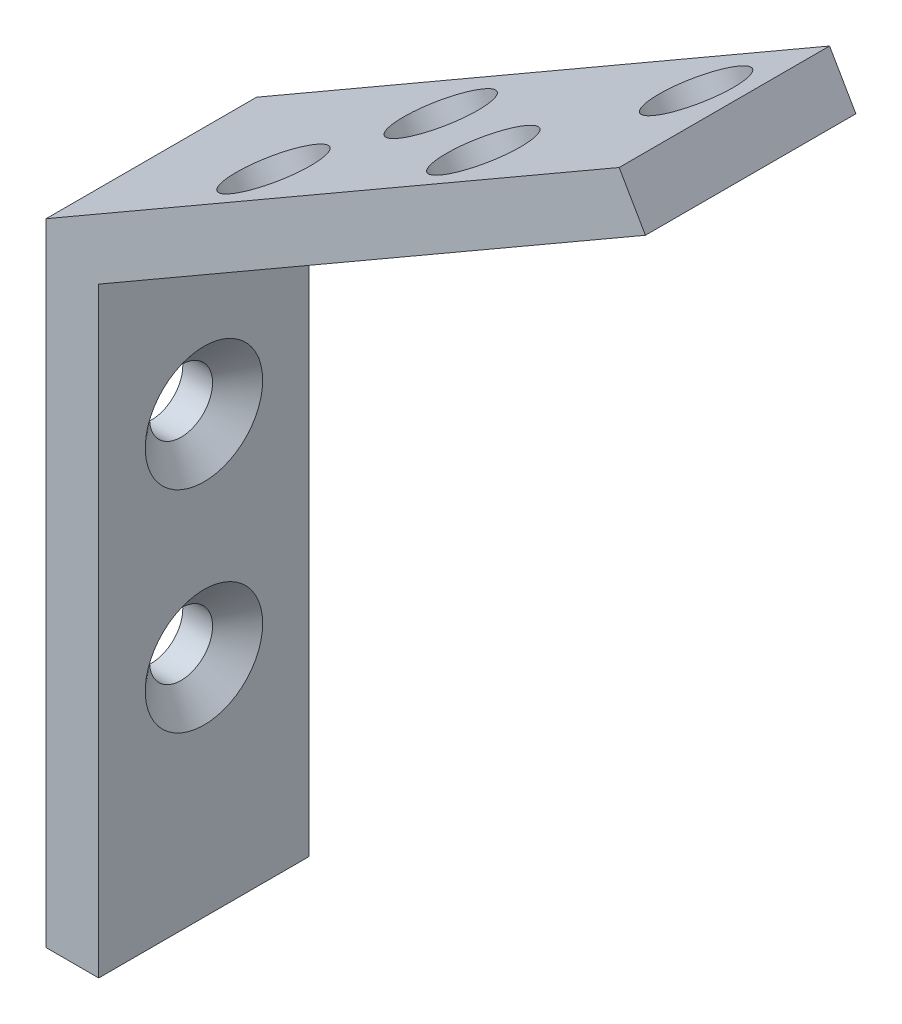
ISO-10303-21;
HEADER;
FILE_DESCRIPTION(('STEP AP214'),'2;1');
FILE_NAME('part.step','',(''),(''),'','','');
FILE_SCHEMA(('AUTOMOTIVE_DESIGN { 1 0 10303 214 1 1 1 1 }'));
ENDSEC;
DATA;
#1=APPLICATION_CONTEXT('core data for automotive mechanical design processes');
#2=APPLICATION_PROTOCOL_DEFINITION('international standard','automotive_design',2000,#1);
#3=PRODUCT_CONTEXT('',#1,'mechanical');
#4=PRODUCT('Part','Part','',(#3));
#5=PRODUCT_RELATED_PRODUCT_CATEGORY('part','',(#4));
#6=PRODUCT_DEFINITION_FORMATION('','',#4);
#7=PRODUCT_DEFINITION_CONTEXT('part definition',#1,'design');
#8=PRODUCT_DEFINITION('design','',#6,#7);
#9=PRODUCT_DEFINITION_SHAPE('','',#8);
#10=(LENGTH_UNIT() NAMED_UNIT(*) SI_UNIT(.MILLI.,.METRE.));
#11=(NAMED_UNIT(*) PLANE_ANGLE_UNIT() SI_UNIT($,.RADIAN.));
#12=(NAMED_UNIT(*) SI_UNIT($,.STERADIAN.) SOLID_ANGLE_UNIT());
#13=UNCERTAINTY_MEASURE_WITH_UNIT(LENGTH_MEASURE(1.E-05),#10,'distance_accuracy_value','');
#14=(GEOMETRIC_REPRESENTATION_CONTEXT(3) GLOBAL_UNCERTAINTY_ASSIGNED_CONTEXT((#13)) GLOBAL_UNIT_ASSIGNED_CONTEXT((#10,
#11,#12)) REPRESENTATION_CONTEXT('',''));
#15=CARTESIAN_POINT('',(0.,0.,0.));
#16=DIRECTION('',(0.,0.,1.));
#17=DIRECTION('',(1.,0.,0.));
#18=AXIS2_PLACEMENT_3D('',#15,#16,#17);
#19=CARTESIAN_POINT('',(-1.5875,-19.05,12.7));
#20=DIRECTION('',(1.,0.,0.));
#21=DIRECTION('',(0.,1.,0.));
#22=AXIS2_PLACEMENT_3D('',#19,#20,#21);
#23=PLANE('',#22);
#24=CARTESIAN_POINT('',(-1.5875,7.24790712370194,6.35));
#25=DIRECTION('',(1.,0.,0.));
#26=DIRECTION('',(0.,1.,0.));
#27=AXIS2_PLACEMENT_3D('',#24,#25,#26);
#28=CIRCLE('',#27,1.89864999999999);
#29=CARTESIAN_POINT('',(-1.5875,9.14655712370193,6.35));
#30=VERTEX_POINT('',#29);
#31=EDGE_CURVE('E36',#30,#30,#28,.T.);
#32=ORIENTED_EDGE('',*,*,#31,.T.);
#33=EDGE_LOOP('',(#32));
#34=FACE_BOUND('',#33,.T.);
#35=CARTESIAN_POINT('',(-1.5875,-5.46366721304636,6.35));
#36=DIRECTION('',(1.,0.,0.));
#37=DIRECTION('',(0.,1.,0.));
#38=AXIS2_PLACEMENT_3D('',#35,#36,#37);
#39=CIRCLE('',#38,1.89864999999999);
#40=CARTESIAN_POINT('',(-1.5875,-3.56501721304637,6.35));
#41=VERTEX_POINT('',#40);
#42=EDGE_CURVE('E123',#41,#41,#39,.T.);
#43=ORIENTED_EDGE('',*,*,#42,.T.);
#44=EDGE_LOOP('',(#43));
#45=FACE_BOUND('',#44,.T.);
#46=DIRECTION('',(0.,-1.,0.));
#47=VECTOR('',#46,1.);
#48=CARTESIAN_POINT('',(-1.5875,-19.05,0.));
#49=LINE('',#48,#47);
#50=CARTESIAN_POINT('',(-1.5875,19.05,0.));
#51=VERTEX_POINT('',#50);
#52=CARTESIAN_POINT('',(-1.5875,-19.05,0.));
#53=VERTEX_POINT('',#52);
#54=EDGE_CURVE('E119',#51,#53,#49,.T.);
#55=ORIENTED_EDGE('',*,*,#54,.T.);
#56=DIRECTION('',(0.,0.,-1.));
#57=VECTOR('',#56,1.);
#58=CARTESIAN_POINT('',(-1.5875,-19.05,12.7));
#59=LINE('',#58,#57);
#60=CARTESIAN_POINT('',(-1.5875,-19.05,12.7));
#61=VERTEX_POINT('',#60);
#62=EDGE_CURVE('E11',#61,#53,#59,.T.);
#63=ORIENTED_EDGE('',*,*,#62,.F.);
#64=DIRECTION('',(0.,-1.,0.));
#65=VECTOR('',#64,1.);
#66=CARTESIAN_POINT('',(-1.5875,-19.05,12.7));
#67=LINE('',#66,#65);
#68=CARTESIAN_POINT('',(-1.5875,19.05,12.7));
#69=VERTEX_POINT('',#68);
#70=EDGE_CURVE('E130',#69,#61,#67,.T.);
#71=ORIENTED_EDGE('',*,*,#70,.F.);
#72=DIRECTION('',(0.,0.,-1.));
#73=VECTOR('',#72,1.);
#74=CARTESIAN_POINT('',(-1.5875,19.05,12.7));
#75=LINE('',#74,#73);
#76=EDGE_CURVE('E115',#69,#51,#75,.T.);
#77=ORIENTED_EDGE('',*,*,#76,.T.);
#78=EDGE_LOOP('',(#55,#63,#71,#77));
#79=FACE_BOUND('',#78,.T.);
#80=ADVANCED_FACE('F33',(#34,#45,#79),#23,.F.);
#81=CARTESIAN_POINT('',(-1.5875,-19.05,12.7));
#82=DIRECTION('',(0.,1.,0.));
#83=DIRECTION('',(0.,0.,1.));
#84=AXIS2_PLACEMENT_3D('',#81,#82,#83);
#85=PLANE('',#84);
#86=DIRECTION('',(1.,0.,0.));
#87=VECTOR('',#86,1.);
#88=CARTESIAN_POINT('',(-1.5875,-19.05,0.));
#89=LINE('',#88,#87);
#90=CARTESIAN_POINT('',(1.5875,-19.05,0.));
#91=VERTEX_POINT('',#90);
#92=EDGE_CURVE('E122',#53,#91,#89,.T.);
#93=ORIENTED_EDGE('',*,*,#92,.T.);
#94=DIRECTION('',(0.,0.,-1.));
#95=VECTOR('',#94,1.);
#96=CARTESIAN_POINT('',(1.5875,-19.05,12.7));
#97=LINE('',#96,#95);
#98=CARTESIAN_POINT('',(1.5875,-19.05,12.7));
#99=VERTEX_POINT('',#98);
#100=EDGE_CURVE('E42',#99,#91,#97,.T.);
#101=ORIENTED_EDGE('',*,*,#100,.F.);
#102=DIRECTION('',(1.,0.,0.));
#103=VECTOR('',#102,1.);
#104=CARTESIAN_POINT('',(-1.5875,-19.05,12.7));
#105=LINE('',#104,#103);
#106=EDGE_CURVE('E88',#61,#99,#105,.T.);
#107=ORIENTED_EDGE('',*,*,#106,.F.);
#108=ORIENTED_EDGE('',*,*,#62,.T.);
#109=EDGE_LOOP('',(#93,#101,#107,#108));
#110=FACE_BOUND('',#109,.T.);
#111=ADVANCED_FACE('F151',(#110),#85,.F.);
#112=CARTESIAN_POINT('',(1.5875,-19.05,12.7));
#113=DIRECTION('',(-1.,0.,0.));
#114=DIRECTION('',(0.,-1.,0.));
#115=AXIS2_PLACEMENT_3D('',#112,#113,#114);
#116=PLANE('',#115);
#117=CARTESIAN_POINT('',(1.58749999999999,7.24790712370194,6.35));
#118=DIRECTION('',(1.,0.,0.));
#119=DIRECTION('',(0.,0.,-1.));
#120=AXIS2_PLACEMENT_3D('',#117,#118,#119);
#121=CIRCLE('',#120,3.5433);
#122=CARTESIAN_POINT('',(1.58749999999999,7.24790712370194,2.8067));
#123=VERTEX_POINT('',#122);
#124=EDGE_CURVE('E182',#123,#123,#121,.T.);
#125=ORIENTED_EDGE('',*,*,#124,.F.);
#126=EDGE_LOOP('',(#125));
#127=FACE_BOUND('',#126,.T.);
#128=CARTESIAN_POINT('',(1.58749999999999,-5.46366721304636,6.35));
#129=DIRECTION('',(1.,0.,0.));
#130=DIRECTION('',(0.,0.,-1.));
#131=AXIS2_PLACEMENT_3D('',#128,#129,#130);
#132=CIRCLE('',#131,3.5433);
#133=CARTESIAN_POINT('',(1.58749999999999,-5.46366721304636,2.8067));
#134=VERTEX_POINT('',#133);
#135=EDGE_CURVE('E140',#134,#134,#132,.T.);
#136=ORIENTED_EDGE('',*,*,#135,.F.);
#137=EDGE_LOOP('',(#136));
#138=FACE_BOUND('',#137,.T.);
#139=DIRECTION('',(0.,1.,0.));
#140=VECTOR('',#139,1.);
#141=CARTESIAN_POINT('',(1.5875,-19.05,0.));
#142=LINE('',#141,#140);
#143=CARTESIAN_POINT('',(1.58749999999999,17.2169128953227,0.));
#144=VERTEX_POINT('',#143);
#145=EDGE_CURVE('E125',#91,#144,#142,.T.);
#146=ORIENTED_EDGE('',*,*,#145,.T.);
#147=DIRECTION('',(0.,0.,-1.));
#148=VECTOR('',#147,1.);
#149=CARTESIAN_POINT('',(1.58749999999999,17.2169128953227,12.7));
#150=LINE('',#149,#148);
#151=CARTESIAN_POINT('',(1.58749999999999,17.2169128953227,12.7));
#152=VERTEX_POINT('',#151);
#153=EDGE_CURVE('E110',#152,#144,#150,.T.);
#154=ORIENTED_EDGE('',*,*,#153,.F.);
#155=DIRECTION('',(0.,1.,0.));
#156=VECTOR('',#155,1.);
#157=CARTESIAN_POINT('',(1.5875,-19.05,12.7));
#158=LINE('',#157,#156);
#159=EDGE_CURVE('E101',#99,#152,#158,.T.);
#160=ORIENTED_EDGE('',*,*,#159,.F.);
#161=ORIENTED_EDGE('',*,*,#100,.T.);
#162=EDGE_LOOP('',(#146,#154,#160,#161));
#163=FACE_BOUND('',#162,.T.);
#164=ADVANCED_FACE('F154',(#127,#138,#163),#116,.F.);
#165=CARTESIAN_POINT('',(34.5830678841869,36.266912895323,12.7));
#166=DIRECTION('',(-0.500000000000009,0.866025403784433,0.));
#167=DIRECTION('',(-0.866025403784433,-0.500000000000009,0.));
#168=AXIS2_PLACEMENT_3D('',#165,#166,#167);
#169=PLANE('',#168);
#170=CARTESIAN_POINT('',(30.5934953574736,33.9635321230735,4.06667061785981));
#171=DIRECTION('',(0.500000000000009,-0.866025403784433,0.));
#172=DIRECTION('',(0.866025403784434,0.500000000000009,0.));
#173=AXIS2_PLACEMENT_3D('',#170,#171,#172);
#174=CIRCLE('',#173,2.5908);
#175=CARTESIAN_POINT('',(32.8371939735983,35.2589321230735,4.06667061785981));
#176=VERTEX_POINT('',#175);
#177=EDGE_CURVE('E208',#176,#176,#174,.T.);
#178=ORIENTED_EDGE('',*,*,#177,.F.);
#179=EDGE_LOOP('',(#178));
#180=FACE_BOUND('',#179,.T.);
#181=CARTESIAN_POINT('',(22.7529591728864,29.436796446311,9.06883198840092));
#182=DIRECTION('',(0.500000000000009,-0.866025403784433,0.));
#183=DIRECTION('',(0.866025403784434,0.500000000000009,0.));
#184=AXIS2_PLACEMENT_3D('',#181,#182,#183);
#185=CIRCLE('',#184,2.5908);
#186=CARTESIAN_POINT('',(24.9966577890111,30.732196446311,9.06883198840092));
#187=VERTEX_POINT('',#186);
#188=EDGE_CURVE('E203',#187,#187,#185,.T.);
#189=ORIENTED_EDGE('',*,*,#188,.F.);
#190=EDGE_LOOP('',(#189));
#191=FACE_BOUND('',#190,.T.);
#192=CARTESIAN_POINT('',(15.1815088928857,25.0654175889966,4.06667061785981));
#193=DIRECTION('',(0.500000000000009,-0.866025403784433,0.));
#194=DIRECTION('',(0.866025403784434,0.500000000000009,0.));
#195=AXIS2_PLACEMENT_3D('',#192,#193,#194);
#196=CIRCLE('',#195,2.5908);
#197=CARTESIAN_POINT('',(17.4252075090104,26.3608175889966,4.06667061785981));
#198=VERTEX_POINT('',#197);
#199=EDGE_CURVE('E197',#198,#198,#196,.T.);
#200=ORIENTED_EDGE('',*,*,#199,.F.);
#201=EDGE_LOOP('',(#200));
#202=FACE_BOUND('',#201,.T.);
#203=CARTESIAN_POINT('',(10.0880248857041,22.1246932263372,9.06883198840092));
#204=DIRECTION('',(0.500000000000009,-0.866025403784433,0.));
#205=DIRECTION('',(0.866025403784434,0.500000000000009,0.));
#206=AXIS2_PLACEMENT_3D('',#203,#204,#205);
#207=CIRCLE('',#206,2.5908);
#208=CARTESIAN_POINT('',(12.3317235018288,23.4200932263372,9.06883198840092));
#209=VERTEX_POINT('',#208);
#210=EDGE_CURVE('E191',#209,#209,#207,.T.);
#211=ORIENTED_EDGE('',*,*,#210,.F.);
#212=EDGE_LOOP('',(#211));
#213=FACE_BOUND('',#212,.T.);
#214=DIRECTION('',(0.866025403784434,0.500000000000009,0.));
#215=VECTOR('',#214,1.);
#216=CARTESIAN_POINT('',(34.5830678841869,36.266912895323,0.));
#217=LINE('',#216,#215);
#218=CARTESIAN_POINT('',(34.5830678841869,36.266912895323,0.));
#219=VERTEX_POINT('',#218);
#220=EDGE_CURVE('E109',#144,#219,#217,.T.);
#221=ORIENTED_EDGE('',*,*,#220,.T.);
#222=DIRECTION('',(0.,0.,-1.));
#223=VECTOR('',#222,1.);
#224=CARTESIAN_POINT('',(34.5830678841869,36.266912895323,12.7));
#225=LINE('',#224,#223);
#226=CARTESIAN_POINT('',(34.5830678841869,36.266912895323,12.7));
#227=VERTEX_POINT('',#226);
#228=EDGE_CURVE('E106',#227,#219,#225,.T.);
#229=ORIENTED_EDGE('',*,*,#228,.F.);
#230=DIRECTION('',(0.866025403784434,0.500000000000009,0.));
#231=VECTOR('',#230,1.);
#232=CARTESIAN_POINT('',(34.5830678841869,36.266912895323,12.7));
#233=LINE('',#232,#231);
#234=EDGE_CURVE('E95',#152,#227,#233,.T.);
#235=ORIENTED_EDGE('',*,*,#234,.F.);
#236=ORIENTED_EDGE('',*,*,#153,.T.);
#237=EDGE_LOOP('',(#221,#229,#235,#236));
#238=FACE_BOUND('',#237,.T.);
#239=ADVANCED_FACE('F107',(#180,#191,#202,#213,#238),#169,.F.);
#240=CARTESIAN_POINT('',(32.9955678841869,39.0165435523386,12.7));
#241=DIRECTION('',(-0.866025403784436,-0.500000000000005,0.));
#242=DIRECTION('',(0.500000000000005,-0.866025403784436,0.));
#243=AXIS2_PLACEMENT_3D('',#240,#241,#242);
#244=PLANE('',#243);
#245=DIRECTION('',(-0.500000000000005,0.866025403784436,0.));
#246=VECTOR('',#245,1.);
#247=CARTESIAN_POINT('',(32.9955678841869,39.0165435523386,0.));
#248=LINE('',#247,#246);
#249=CARTESIAN_POINT('',(32.9955678841869,39.0165435523386,0.));
#250=VERTEX_POINT('',#249);
#251=EDGE_CURVE('E74',#219,#250,#248,.T.);
#252=ORIENTED_EDGE('',*,*,#251,.T.);
#253=DIRECTION('',(0.,0.,-1.));
#254=VECTOR('',#253,1.);
#255=CARTESIAN_POINT('',(32.9955678841869,39.0165435523386,12.7));
#256=LINE('',#255,#254);
#257=CARTESIAN_POINT('',(32.9955678841869,39.0165435523386,12.7));
#258=VERTEX_POINT('',#257);
#259=EDGE_CURVE('E111',#258,#250,#256,.T.);
#260=ORIENTED_EDGE('',*,*,#259,.F.);
#261=DIRECTION('',(-0.500000000000005,0.866025403784436,0.));
#262=VECTOR('',#261,1.);
#263=CARTESIAN_POINT('',(32.9955678841869,39.0165435523386,12.7));
#264=LINE('',#263,#262);
#265=EDGE_CURVE('E99',#227,#258,#264,.T.);
#266=ORIENTED_EDGE('',*,*,#265,.F.);
#267=ORIENTED_EDGE('',*,*,#228,.T.);
#268=EDGE_LOOP('',(#252,#260,#266,#267));
#269=FACE_BOUND('',#268,.T.);
#270=ADVANCED_FACE('F113',(#269),#244,.F.);
#271=CARTESIAN_POINT('',(-1.5875,19.05,12.7));
#272=DIRECTION('',(0.500000000000004,-0.866025403784436,0.));
#273=DIRECTION('',(0.866025403784436,0.500000000000004,0.));
#274=AXIS2_PLACEMENT_3D('',#271,#272,#273);
#275=PLANE('',#274);
#276=CARTESIAN_POINT('',(29.0059953574736,36.7131627800891,4.06667061785981));
#277=DIRECTION('',(0.500000000000004,-0.866025403784436,0.));
#278=DIRECTION('',(0.866025403784436,0.500000000000004,0.));
#279=AXIS2_PLACEMENT_3D('',#276,#277,#278);
#280=CIRCLE('',#279,2.5908);
#281=CARTESIAN_POINT('',(31.2496939735983,38.0085627800891,4.06667061785981));
#282=VERTEX_POINT('',#281);
#283=EDGE_CURVE('E206',#282,#282,#280,.T.);
#284=ORIENTED_EDGE('',*,*,#283,.T.);
#285=EDGE_LOOP('',(#284));
#286=FACE_BOUND('',#285,.T.);
#287=CARTESIAN_POINT('',(21.1654591728864,32.1864271033266,9.06883198840092));
#288=DIRECTION('',(0.500000000000004,-0.866025403784436,0.));
#289=DIRECTION('',(0.866025403784436,0.500000000000004,0.));
#290=AXIS2_PLACEMENT_3D('',#287,#288,#289);
#291=CIRCLE('',#290,2.5908);
#292=CARTESIAN_POINT('',(23.4091577890111,33.4818271033267,9.06883198840092));
#293=VERTEX_POINT('',#292);
#294=EDGE_CURVE('E200',#293,#293,#291,.T.);
#295=ORIENTED_EDGE('',*,*,#294,.T.);
#296=EDGE_LOOP('',(#295));
#297=FACE_BOUND('',#296,.T.);
#298=CARTESIAN_POINT('',(13.5940088928856,27.8150482460123,4.06667061785981));
#299=DIRECTION('',(0.500000000000004,-0.866025403784436,0.));
#300=DIRECTION('',(0.866025403784436,0.500000000000004,0.));
#301=AXIS2_PLACEMENT_3D('',#298,#299,#300);
#302=CIRCLE('',#301,2.5908);
#303=CARTESIAN_POINT('',(15.8377075090103,29.1104482460123,4.06667061785981));
#304=VERTEX_POINT('',#303);
#305=EDGE_CURVE('E194',#304,#304,#302,.T.);
#306=ORIENTED_EDGE('',*,*,#305,.T.);
#307=EDGE_LOOP('',(#306));
#308=FACE_BOUND('',#307,.T.);
#309=CARTESIAN_POINT('',(8.50052488570402,24.8743238833529,9.06883198840092));
#310=DIRECTION('',(0.500000000000004,-0.866025403784436,0.));
#311=DIRECTION('',(0.866025403784436,0.500000000000004,0.));
#312=AXIS2_PLACEMENT_3D('',#309,#310,#311);
#313=CIRCLE('',#312,2.5908);
#314=CARTESIAN_POINT('',(10.7442235018287,26.1697238833529,9.06883198840092));
#315=VERTEX_POINT('',#314);
#316=EDGE_CURVE('E186',#315,#315,#313,.T.);
#317=ORIENTED_EDGE('',*,*,#316,.T.);
#318=EDGE_LOOP('',(#317));
#319=FACE_BOUND('',#318,.T.);
#320=DIRECTION('',(-0.866025403784436,-0.500000000000004,0.));
#321=VECTOR('',#320,1.);
#322=CARTESIAN_POINT('',(-1.5875,19.05,0.));
#323=LINE('',#322,#321);
#324=EDGE_CURVE('E80',#250,#51,#323,.T.);
#325=ORIENTED_EDGE('',*,*,#324,.T.);
#326=ORIENTED_EDGE('',*,*,#76,.F.);
#327=DIRECTION('',(-0.866025403784436,-0.500000000000004,0.));
#328=VECTOR('',#327,1.);
#329=CARTESIAN_POINT('',(-1.5875,19.05,12.7));
#330=LINE('',#329,#328);
#331=EDGE_CURVE('E51',#258,#69,#330,.T.);
#332=ORIENTED_EDGE('',*,*,#331,.F.);
#333=ORIENTED_EDGE('',*,*,#259,.T.);
#334=EDGE_LOOP('',(#325,#326,#332,#333));
#335=FACE_BOUND('',#334,.T.);
#336=ADVANCED_FACE('F159',(#286,#297,#308,#319,#335),#275,.F.);
#337=CARTESIAN_POINT('',(0.,0.,12.7));
#338=DIRECTION('',(0.,0.,-1.));
#339=DIRECTION('',(-1.,0.,0.));
#340=AXIS2_PLACEMENT_3D('',#337,#338,#339);
#341=PLANE('',#340);
#342=ORIENTED_EDGE('',*,*,#70,.T.);
#343=ORIENTED_EDGE('',*,*,#106,.T.);
#344=ORIENTED_EDGE('',*,*,#159,.T.);
#345=ORIENTED_EDGE('',*,*,#234,.T.);
#346=ORIENTED_EDGE('',*,*,#265,.T.);
#347=ORIENTED_EDGE('',*,*,#331,.T.);
#348=EDGE_LOOP('',(#342,#343,#344,#345,#346,#347));
#349=FACE_BOUND('',#348,.T.);
#350=ADVANCED_FACE('F97',(#349),#341,.F.);
#351=CARTESIAN_POINT('',(0.,0.,0.));
#352=DIRECTION('',(0.,0.,-1.));
#353=DIRECTION('',(-1.,0.,0.));
#354=AXIS2_PLACEMENT_3D('',#351,#352,#353);
#355=PLANE('',#354);
#356=ORIENTED_EDGE('',*,*,#54,.F.);
#357=ORIENTED_EDGE('',*,*,#324,.F.);
#358=ORIENTED_EDGE('',*,*,#251,.F.);
#359=ORIENTED_EDGE('',*,*,#220,.F.);
#360=ORIENTED_EDGE('',*,*,#145,.F.);
#361=ORIENTED_EDGE('',*,*,#92,.F.);
#362=EDGE_LOOP('',(#356,#357,#358,#359,#360,#361));
#363=FACE_BOUND('',#362,.T.);
#364=ADVANCED_FACE('F157',(#363),#355,.T.);
#365=CARTESIAN_POINT('',(1.58749999999999,-5.46366721304636,6.35));
#366=DIRECTION('',(1.,0.,0.));
#367=DIRECTION('',(0.,0.,-1.));
#368=AXIS2_PLACEMENT_3D('',#365,#366,#367);
#369=CYLINDRICAL_SURFACE('',#368,1.89864999999999);
#370=CARTESIAN_POINT('',(0.207474791584277,-5.46366721304636,6.35));
#371=DIRECTION('',(1.,0.,0.));
#372=DIRECTION('',(0.,0.,-1.));
#373=AXIS2_PLACEMENT_3D('',#370,#371,#372);
#374=CIRCLE('',#373,1.89865);
#375=CARTESIAN_POINT('',(0.207474791584277,-5.46366721304636,4.45135));
#376=VERTEX_POINT('',#375);
#377=EDGE_CURVE('E136',#376,#376,#374,.T.);
#378=ORIENTED_EDGE('',*,*,#377,.T.);
#379=EDGE_LOOP('',(#378));
#380=FACE_BOUND('',#379,.T.);
#381=ORIENTED_EDGE('',*,*,#42,.F.);
#382=EDGE_LOOP('',(#381));
#383=FACE_BOUND('',#382,.T.);
#384=ADVANCED_FACE('F249',(#380,#383),#369,.F.);
#385=CARTESIAN_POINT('',(1.58749999999999,-5.46366721304636,6.35));
#386=DIRECTION('',(1.,0.,0.));
#387=DIRECTION('',(0.,0.,-1.));
#388=AXIS2_PLACEMENT_3D('',#385,#386,#387);
#389=CONICAL_SURFACE('',#388,3.5433,0.872664625997164);
#390=ORIENTED_EDGE('',*,*,#377,.F.);
#391=EDGE_LOOP('',(#390));
#392=FACE_BOUND('',#391,.T.);
#393=ORIENTED_EDGE('',*,*,#135,.T.);
#394=EDGE_LOOP('',(#393));
#395=FACE_BOUND('',#394,.T.);
#396=ADVANCED_FACE('F246',(#392,#395),#389,.F.);
#397=CARTESIAN_POINT('',(1.58749999999999,7.24790712370194,6.35));
#398=DIRECTION('',(1.,0.,0.));
#399=DIRECTION('',(0.,0.,-1.));
#400=AXIS2_PLACEMENT_3D('',#397,#398,#399);
#401=CYLINDRICAL_SURFACE('',#400,1.89864999999999);
#402=CARTESIAN_POINT('',(0.207474791584276,7.24790712370194,6.35));
#403=DIRECTION('',(1.,0.,0.));
#404=DIRECTION('',(0.,0.,-1.));
#405=AXIS2_PLACEMENT_3D('',#402,#403,#404);
#406=CIRCLE('',#405,1.89865);
#407=CARTESIAN_POINT('',(0.207474791584276,7.24790712370194,4.45135));
#408=VERTEX_POINT('',#407);
#409=EDGE_CURVE('E180',#408,#408,#406,.T.);
#410=ORIENTED_EDGE('',*,*,#409,.T.);
#411=EDGE_LOOP('',(#410));
#412=FACE_BOUND('',#411,.T.);
#413=ORIENTED_EDGE('',*,*,#31,.F.);
#414=EDGE_LOOP('',(#413));
#415=FACE_BOUND('',#414,.T.);
#416=ADVANCED_FACE('F239',(#412,#415),#401,.F.);
#417=CARTESIAN_POINT('',(1.58749999999999,7.24790712370194,6.35));
#418=DIRECTION('',(1.,0.,0.));
#419=DIRECTION('',(0.,0.,-1.));
#420=AXIS2_PLACEMENT_3D('',#417,#418,#419);
#421=CONICAL_SURFACE('',#420,3.5433,0.872664625997164);
#422=ORIENTED_EDGE('',*,*,#409,.F.);
#423=EDGE_LOOP('',(#422));
#424=FACE_BOUND('',#423,.T.);
#425=ORIENTED_EDGE('',*,*,#124,.T.);
#426=EDGE_LOOP('',(#425));
#427=FACE_BOUND('',#426,.T.);
#428=ADVANCED_FACE('F228',(#424,#427),#421,.F.);
#429=CARTESIAN_POINT('',(10.0880248857041,22.1246932263372,9.06883198840092));
#430=DIRECTION('',(0.500000000000009,-0.866025403784433,0.));
#431=DIRECTION('',(0.866025403784434,0.500000000000009,0.));
#432=AXIS2_PLACEMENT_3D('',#429,#430,#431);
#433=CYLINDRICAL_SURFACE('',#432,2.5908);
#434=ORIENTED_EDGE('',*,*,#210,.T.);
#435=EDGE_LOOP('',(#434));
#436=FACE_BOUND('',#435,.T.);
#437=ORIENTED_EDGE('',*,*,#316,.F.);
#438=EDGE_LOOP('',(#437));
#439=FACE_BOUND('',#438,.T.);
#440=ADVANCED_FACE('F224',(#436,#439),#433,.F.);
#441=CARTESIAN_POINT('',(15.1815088928857,25.0654175889966,4.06667061785981));
#442=DIRECTION('',(0.500000000000009,-0.866025403784433,0.));
#443=DIRECTION('',(0.866025403784434,0.500000000000009,0.));
#444=AXIS2_PLACEMENT_3D('',#441,#442,#443);
#445=CYLINDRICAL_SURFACE('',#444,2.5908);
#446=ORIENTED_EDGE('',*,*,#199,.T.);
#447=EDGE_LOOP('',(#446));
#448=FACE_BOUND('',#447,.T.);
#449=ORIENTED_EDGE('',*,*,#305,.F.);
#450=EDGE_LOOP('',(#449));
#451=FACE_BOUND('',#450,.T.);
#452=ADVANCED_FACE('F227',(#448,#451),#445,.F.);
#453=CARTESIAN_POINT('',(22.7529591728864,29.436796446311,9.06883198840092));
#454=DIRECTION('',(0.500000000000009,-0.866025403784433,0.));
#455=DIRECTION('',(0.866025403784434,0.500000000000009,0.));
#456=AXIS2_PLACEMENT_3D('',#453,#454,#455);
#457=CYLINDRICAL_SURFACE('',#456,2.5908);
#458=ORIENTED_EDGE('',*,*,#188,.T.);
#459=EDGE_LOOP('',(#458));
#460=FACE_BOUND('',#459,.T.);
#461=ORIENTED_EDGE('',*,*,#294,.F.);
#462=EDGE_LOOP('',(#461));
#463=FACE_BOUND('',#462,.T.);
#464=ADVANCED_FACE('F236',(#460,#463),#457,.F.);
#465=CARTESIAN_POINT('',(30.5934953574736,33.9635321230735,4.06667061785981));
#466=DIRECTION('',(0.500000000000009,-0.866025403784433,0.));
#467=DIRECTION('',(0.866025403784434,0.500000000000009,0.));
#468=AXIS2_PLACEMENT_3D('',#465,#466,#467);
#469=CYLINDRICAL_SURFACE('',#468,2.5908);
#470=ORIENTED_EDGE('',*,*,#177,.T.);
#471=EDGE_LOOP('',(#470));
#472=FACE_BOUND('',#471,.T.);
#473=ORIENTED_EDGE('',*,*,#283,.F.);
#474=EDGE_LOOP('',(#473));
#475=FACE_BOUND('',#474,.T.);
#476=ADVANCED_FACE('F212',(#472,#475),#469,.F.);
#477=CLOSED_SHELL('',(#80,#111,#164,#239,#270,#336,#350,#364,#384,#396,#416,#428,#440,#452,#464,#476));
#478=MANIFOLD_SOLID_BREP('B2',#477);
#479=ADVANCED_BREP_SHAPE_REPRESENTATION('',(#18,#478),#14);
#480=SHAPE_DEFINITION_REPRESENTATION(#9,#479);
ENDSEC;
END-ISO-10303-21;
